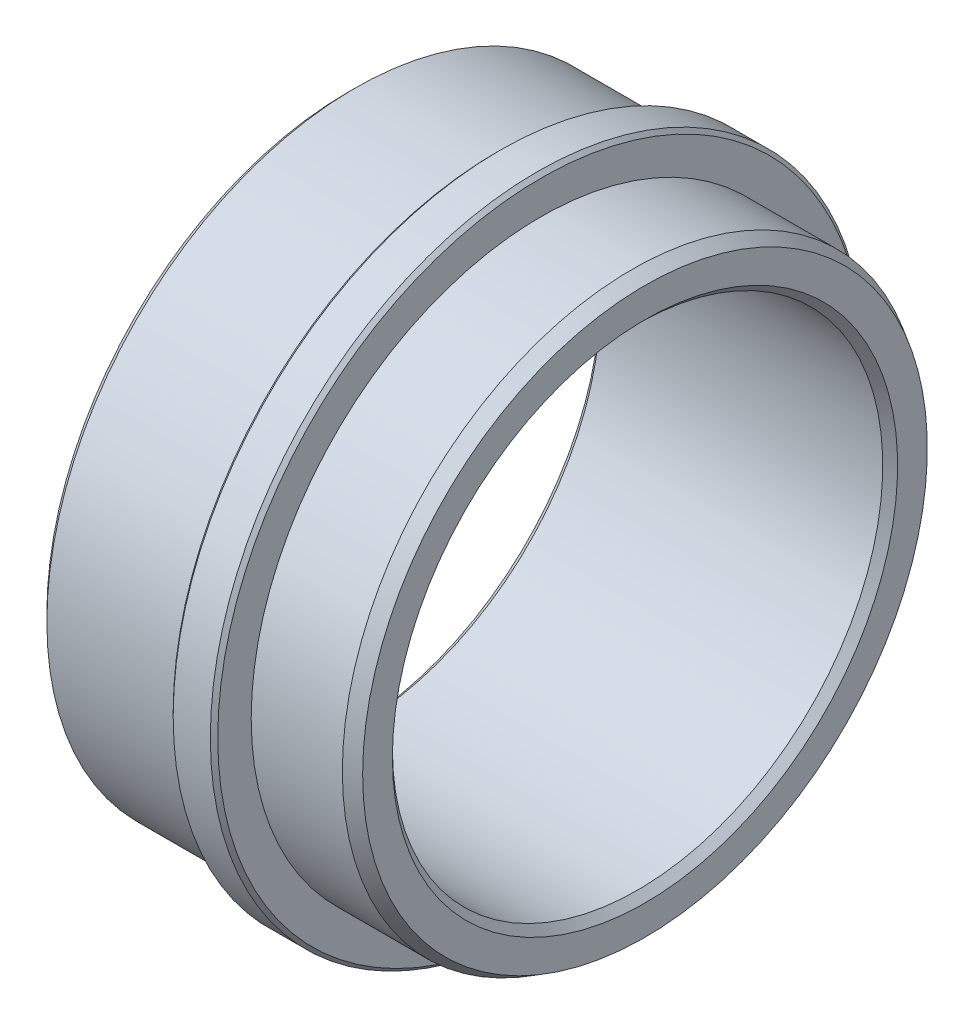
ISO-10303-21;
HEADER;
FILE_DESCRIPTION(('STEP AP214'),'2;1');
FILE_NAME('part.step','',(''),(''),'','','');
FILE_SCHEMA(('AUTOMOTIVE_DESIGN { 1 0 10303 214 1 1 1 1 }'));
ENDSEC;
DATA;
#1=APPLICATION_CONTEXT('core data for automotive mechanical design processes');
#2=APPLICATION_PROTOCOL_DEFINITION('international standard','automotive_design',2000,#1);
#3=PRODUCT_CONTEXT('',#1,'mechanical');
#4=PRODUCT('Part','Part','',(#3));
#5=PRODUCT_RELATED_PRODUCT_CATEGORY('part','',(#4));
#6=PRODUCT_DEFINITION_FORMATION('','',#4);
#7=PRODUCT_DEFINITION_CONTEXT('part definition',#1,'design');
#8=PRODUCT_DEFINITION('design','',#6,#7);
#9=PRODUCT_DEFINITION_SHAPE('','',#8);
#10=(LENGTH_UNIT() NAMED_UNIT(*) SI_UNIT(.MILLI.,.METRE.));
#11=(NAMED_UNIT(*) PLANE_ANGLE_UNIT() SI_UNIT($,.RADIAN.));
#12=(NAMED_UNIT(*) SI_UNIT($,.STERADIAN.) SOLID_ANGLE_UNIT());
#13=UNCERTAINTY_MEASURE_WITH_UNIT(LENGTH_MEASURE(1.E-05),#10,'distance_accuracy_value','');
#14=(GEOMETRIC_REPRESENTATION_CONTEXT(3) GLOBAL_UNCERTAINTY_ASSIGNED_CONTEXT((#13)) GLOBAL_UNIT_ASSIGNED_CONTEXT((#10,
#11,#12)) REPRESENTATION_CONTEXT('',''));
#15=CARTESIAN_POINT('',(0.,0.,0.));
#16=DIRECTION('',(0.,0.,1.));
#17=DIRECTION('',(1.,0.,0.));
#18=AXIS2_PLACEMENT_3D('',#15,#16,#17);
#19=CARTESIAN_POINT('',(-3.94105242786513,20.75,0.));
#20=DIRECTION('',(1.,0.,0.));
#21=DIRECTION('',(0.,0.,-1.));
#22=AXIS2_PLACEMENT_3D('',#19,#20,#21);
#23=PLANE('',#22);
#24=CARTESIAN_POINT('',(-3.94105242786513,0.,0.));
#25=DIRECTION('',(-1.,0.,0.));
#26=DIRECTION('',(0.,0.,1.));
#27=AXIS2_PLACEMENT_3D('',#24,#25,#26);
#28=CIRCLE('',#27,20.75);
#29=CARTESIAN_POINT('',(-3.94105242786513,0.,20.75));
#30=VERTEX_POINT('',#29);
#31=EDGE_CURVE('E79',#30,#30,#28,.T.);
#32=ORIENTED_EDGE('',*,*,#31,.F.);
#33=EDGE_LOOP('',(#32));
#34=FACE_BOUND('',#33,.T.);
#35=CARTESIAN_POINT('',(-3.94105242786513,0.,0.));
#36=DIRECTION('',(-1.,0.,0.));
#37=DIRECTION('',(0.,0.,1.));
#38=AXIS2_PLACEMENT_3D('',#35,#36,#37);
#39=CIRCLE('',#38,21.75);
#40=CARTESIAN_POINT('',(-3.94105242786513,0.,21.75));
#41=VERTEX_POINT('',#40);
#42=EDGE_CURVE('E10',#41,#41,#39,.T.);
#43=ORIENTED_EDGE('',*,*,#42,.T.);
#44=EDGE_LOOP('',(#43));
#45=FACE_BOUND('',#44,.T.);
#46=ADVANCED_FACE('F33',(#34,#45),#23,.F.);
#47=CARTESIAN_POINT('',(-3.69105242786513,0.,0.));
#48=DIRECTION('',(1.,0.,0.));
#49=DIRECTION('',(0.,0.,-1.));
#50=AXIS2_PLACEMENT_3D('',#47,#48,#49);
#51=CONICAL_SURFACE('',#50,22.,0.785398163397449);
#52=ORIENTED_EDGE('',*,*,#42,.F.);
#53=EDGE_LOOP('',(#52));
#54=FACE_BOUND('',#53,.T.);
#55=CARTESIAN_POINT('',(-3.69105242786513,0.,0.));
#56=DIRECTION('',(-1.,0.,0.));
#57=DIRECTION('',(0.,0.,1.));
#58=AXIS2_PLACEMENT_3D('',#55,#56,#57);
#59=CIRCLE('',#58,22.);
#60=CARTESIAN_POINT('',(-3.69105242786513,0.,22.));
#61=VERTEX_POINT('',#60);
#62=EDGE_CURVE('E39',#61,#61,#59,.T.);
#63=ORIENTED_EDGE('',*,*,#62,.T.);
#64=EDGE_LOOP('',(#63));
#65=FACE_BOUND('',#64,.T.);
#66=ADVANCED_FACE('F86',(#54,#65),#51,.T.);
#67=CARTESIAN_POINT('',(0.,0.,0.));
#68=DIRECTION('',(-1.,0.,0.));
#69=DIRECTION('',(0.,0.,1.));
#70=AXIS2_PLACEMENT_3D('',#67,#68,#69);
#71=CYLINDRICAL_SURFACE('',#70,22.);
#72=ORIENTED_EDGE('',*,*,#62,.F.);
#73=EDGE_LOOP('',(#72));
#74=FACE_BOUND('',#73,.T.);
#75=CARTESIAN_POINT('',(-1.19105242786513,0.,0.));
#76=DIRECTION('',(-1.,0.,0.));
#77=DIRECTION('',(0.,0.,1.));
#78=AXIS2_PLACEMENT_3D('',#75,#76,#77);
#79=CIRCLE('',#78,22.);
#80=CARTESIAN_POINT('',(-1.19105242786513,0.,22.));
#81=VERTEX_POINT('',#80);
#82=EDGE_CURVE('E43',#81,#81,#79,.T.);
#83=ORIENTED_EDGE('',*,*,#82,.T.);
#84=EDGE_LOOP('',(#83));
#85=FACE_BOUND('',#84,.T.);
#86=ADVANCED_FACE('F90',(#74,#85),#71,.T.);
#87=CARTESIAN_POINT('',(-0.94105242786513,0.,0.));
#88=DIRECTION('',(-1.,0.,0.));
#89=DIRECTION('',(0.,0.,1.));
#90=AXIS2_PLACEMENT_3D('',#87,#88,#89);
#91=CONICAL_SURFACE('',#90,21.75,0.785398163397449);
#92=ORIENTED_EDGE('',*,*,#82,.F.);
#93=EDGE_LOOP('',(#92));
#94=FACE_BOUND('',#93,.T.);
#95=CARTESIAN_POINT('',(-0.94105242786513,0.,0.));
#96=DIRECTION('',(-1.,0.,0.));
#97=DIRECTION('',(0.,0.,1.));
#98=AXIS2_PLACEMENT_3D('',#95,#96,#97);
#99=CIRCLE('',#98,21.75);
#100=CARTESIAN_POINT('',(-0.94105242786513,0.,21.75));
#101=VERTEX_POINT('',#100);
#102=EDGE_CURVE('E47',#101,#101,#99,.T.);
#103=ORIENTED_EDGE('',*,*,#102,.T.);
#104=EDGE_LOOP('',(#103));
#105=FACE_BOUND('',#104,.T.);
#106=ADVANCED_FACE('F95',(#94,#105),#91,.T.);
#107=CARTESIAN_POINT('',(-0.941052427865129,21.75,0.));
#108=DIRECTION('',(-1.,0.,0.));
#109=DIRECTION('',(0.,0.,1.));
#110=AXIS2_PLACEMENT_3D('',#107,#108,#109);
#111=PLANE('',#110);
#112=ORIENTED_EDGE('',*,*,#102,.F.);
#113=EDGE_LOOP('',(#112));
#114=FACE_BOUND('',#113,.T.);
#115=CARTESIAN_POINT('',(-0.941052427865128,0.,0.));
#116=DIRECTION('',(-1.,0.,0.));
#117=DIRECTION('',(0.,0.,1.));
#118=AXIS2_PLACEMENT_3D('',#115,#116,#117);
#119=CIRCLE('',#118,19.5);
#120=CARTESIAN_POINT('',(-0.941052427865128,0.,19.5));
#121=VERTEX_POINT('',#120);
#122=EDGE_CURVE('E52',#121,#121,#119,.T.);
#123=ORIENTED_EDGE('',*,*,#122,.T.);
#124=EDGE_LOOP('',(#123));
#125=FACE_BOUND('',#124,.T.);
#126=ADVANCED_FACE('F101',(#114,#125),#111,.F.);
#127=CARTESIAN_POINT('',(0.,0.,0.));
#128=DIRECTION('',(-1.,0.,0.));
#129=DIRECTION('',(0.,0.,1.));
#130=AXIS2_PLACEMENT_3D('',#127,#128,#129);
#131=CYLINDRICAL_SURFACE('',#130,19.5);
#132=ORIENTED_EDGE('',*,*,#122,.F.);
#133=EDGE_LOOP('',(#132));
#134=FACE_BOUND('',#133,.T.);
#135=CARTESIAN_POINT('',(5.19292216835042,0.,0.));
#136=DIRECTION('',(-1.,0.,0.));
#137=DIRECTION('',(0.,0.,1.));
#138=AXIS2_PLACEMENT_3D('',#135,#136,#137);
#139=CIRCLE('',#138,19.5);
#140=CARTESIAN_POINT('',(5.19292216835042,0.,19.5));
#141=VERTEX_POINT('',#140);
#142=EDGE_CURVE('E55',#141,#141,#139,.T.);
#143=ORIENTED_EDGE('',*,*,#142,.T.);
#144=EDGE_LOOP('',(#143));
#145=FACE_BOUND('',#144,.T.);
#146=ADVANCED_FACE('F105',(#134,#145),#131,.T.);
#147=CARTESIAN_POINT('',(6.05894757213487,0.,0.));
#148=DIRECTION('',(-1.,0.,0.));
#149=DIRECTION('',(0.,0.,1.));
#150=AXIS2_PLACEMENT_3D('',#147,#148,#149);
#151=CONICAL_SURFACE('',#150,19.,0.523598775598295);
#152=ORIENTED_EDGE('',*,*,#142,.F.);
#153=EDGE_LOOP('',(#152));
#154=FACE_BOUND('',#153,.T.);
#155=CARTESIAN_POINT('',(6.05894757213487,0.,0.));
#156=DIRECTION('',(-1.,0.,0.));
#157=DIRECTION('',(0.,0.,1.));
#158=AXIS2_PLACEMENT_3D('',#155,#156,#157);
#159=CIRCLE('',#158,19.);
#160=CARTESIAN_POINT('',(6.05894757213487,0.,19.));
#161=VERTEX_POINT('',#160);
#162=EDGE_CURVE('E58',#161,#161,#159,.T.);
#163=ORIENTED_EDGE('',*,*,#162,.T.);
#164=EDGE_LOOP('',(#163));
#165=FACE_BOUND('',#164,.T.);
#166=ADVANCED_FACE('F109',(#154,#165),#151,.T.);
#167=CARTESIAN_POINT('',(6.05894757213487,19.,0.));
#168=DIRECTION('',(-1.,0.,0.));
#169=DIRECTION('',(0.,0.,1.));
#170=AXIS2_PLACEMENT_3D('',#167,#168,#169);
#171=PLANE('',#170);
#172=ORIENTED_EDGE('',*,*,#162,.F.);
#173=EDGE_LOOP('',(#172));
#174=FACE_BOUND('',#173,.T.);
#175=CARTESIAN_POINT('',(6.05894757213487,0.,0.));
#176=DIRECTION('',(-1.,0.,0.));
#177=DIRECTION('',(0.,0.,1.));
#178=AXIS2_PLACEMENT_3D('',#175,#176,#177);
#179=CIRCLE('',#178,17.);
#180=CARTESIAN_POINT('',(6.05894757213487,0.,17.));
#181=VERTEX_POINT('',#180);
#182=EDGE_CURVE('E61',#181,#181,#179,.T.);
#183=ORIENTED_EDGE('',*,*,#182,.T.);
#184=EDGE_LOOP('',(#183));
#185=FACE_BOUND('',#184,.T.);
#186=ADVANCED_FACE('F113',(#174,#185),#171,.F.);
#187=CARTESIAN_POINT('',(5.55894757213487,0.,0.));
#188=DIRECTION('',(1.,0.,0.));
#189=DIRECTION('',(0.,0.,-1.));
#190=AXIS2_PLACEMENT_3D('',#187,#188,#189);
#191=CONICAL_SURFACE('',#190,16.5,0.785398163397448);
#192=ORIENTED_EDGE('',*,*,#182,.F.);
#193=EDGE_LOOP('',(#192));
#194=FACE_BOUND('',#193,.T.);
#195=CARTESIAN_POINT('',(5.55894757213487,0.,0.));
#196=DIRECTION('',(-1.,0.,0.));
#197=DIRECTION('',(0.,0.,1.));
#198=AXIS2_PLACEMENT_3D('',#195,#196,#197);
#199=CIRCLE('',#198,16.5);
#200=CARTESIAN_POINT('',(5.55894757213487,0.,16.5));
#201=VERTEX_POINT('',#200);
#202=EDGE_CURVE('E64',#201,#201,#199,.T.);
#203=ORIENTED_EDGE('',*,*,#202,.T.);
#204=EDGE_LOOP('',(#203));
#205=FACE_BOUND('',#204,.T.);
#206=ADVANCED_FACE('F117',(#194,#205),#191,.F.);
#207=CARTESIAN_POINT('',(0.,0.,0.));
#208=DIRECTION('',(-1.,0.,0.));
#209=DIRECTION('',(0.,0.,1.));
#210=AXIS2_PLACEMENT_3D('',#207,#208,#209);
#211=CYLINDRICAL_SURFACE('',#210,16.5);
#212=ORIENTED_EDGE('',*,*,#202,.F.);
#213=EDGE_LOOP('',(#212));
#214=FACE_BOUND('',#213,.T.);
#215=CARTESIAN_POINT('',(-13.4410524278651,0.,0.));
#216=DIRECTION('',(-1.,0.,0.));
#217=DIRECTION('',(0.,0.,1.));
#218=AXIS2_PLACEMENT_3D('',#215,#216,#217);
#219=CIRCLE('',#218,16.5);
#220=CARTESIAN_POINT('',(-13.4410524278651,0.,16.5));
#221=VERTEX_POINT('',#220);
#222=EDGE_CURVE('E67',#221,#221,#219,.T.);
#223=ORIENTED_EDGE('',*,*,#222,.T.);
#224=EDGE_LOOP('',(#223));
#225=FACE_BOUND('',#224,.T.);
#226=ADVANCED_FACE('F121',(#214,#225),#211,.F.);
#227=CARTESIAN_POINT('',(-13.9410524278651,0.,0.));
#228=DIRECTION('',(-1.,0.,0.));
#229=DIRECTION('',(0.,0.,1.));
#230=AXIS2_PLACEMENT_3D('',#227,#228,#229);
#231=CONICAL_SURFACE('',#230,17.,0.785398163397443);
#232=ORIENTED_EDGE('',*,*,#222,.F.);
#233=EDGE_LOOP('',(#232));
#234=FACE_BOUND('',#233,.T.);
#235=CARTESIAN_POINT('',(-13.9410524278651,0.,0.));
#236=DIRECTION('',(-1.,0.,0.));
#237=DIRECTION('',(0.,0.,1.));
#238=AXIS2_PLACEMENT_3D('',#235,#236,#237);
#239=CIRCLE('',#238,17.);
#240=CARTESIAN_POINT('',(-13.9410524278651,0.,17.));
#241=VERTEX_POINT('',#240);
#242=EDGE_CURVE('E70',#241,#241,#239,.T.);
#243=ORIENTED_EDGE('',*,*,#242,.T.);
#244=EDGE_LOOP('',(#243));
#245=FACE_BOUND('',#244,.T.);
#246=ADVANCED_FACE('F125',(#234,#245),#231,.F.);
#247=CARTESIAN_POINT('',(-13.9410524278651,17.,0.));
#248=DIRECTION('',(1.,0.,0.));
#249=DIRECTION('',(0.,0.,-1.));
#250=AXIS2_PLACEMENT_3D('',#247,#248,#249);
#251=PLANE('',#250);
#252=ORIENTED_EDGE('',*,*,#242,.F.);
#253=EDGE_LOOP('',(#252));
#254=FACE_BOUND('',#253,.T.);
#255=CARTESIAN_POINT('',(-13.9410524278651,0.,0.));
#256=DIRECTION('',(-1.,0.,0.));
#257=DIRECTION('',(0.,0.,1.));
#258=AXIS2_PLACEMENT_3D('',#255,#256,#257);
#259=CIRCLE('',#258,20.25);
#260=CARTESIAN_POINT('',(-13.9410524278651,0.,20.25));
#261=VERTEX_POINT('',#260);
#262=EDGE_CURVE('E73',#261,#261,#259,.T.);
#263=ORIENTED_EDGE('',*,*,#262,.T.);
#264=EDGE_LOOP('',(#263));
#265=FACE_BOUND('',#264,.T.);
#266=ADVANCED_FACE('F129',(#254,#265),#251,.F.);
#267=CARTESIAN_POINT('',(-13.4410524278651,0.,0.));
#268=DIRECTION('',(1.,0.,0.));
#269=DIRECTION('',(0.,0.,-1.));
#270=AXIS2_PLACEMENT_3D('',#267,#268,#269);
#271=CONICAL_SURFACE('',#270,20.75,0.785398163397438);
#272=ORIENTED_EDGE('',*,*,#262,.F.);
#273=EDGE_LOOP('',(#272));
#274=FACE_BOUND('',#273,.T.);
#275=CARTESIAN_POINT('',(-13.4410524278651,0.,0.));
#276=DIRECTION('',(-1.,0.,0.));
#277=DIRECTION('',(0.,0.,1.));
#278=AXIS2_PLACEMENT_3D('',#275,#276,#277);
#279=CIRCLE('',#278,20.75);
#280=CARTESIAN_POINT('',(-13.4410524278651,0.,20.75));
#281=VERTEX_POINT('',#280);
#282=EDGE_CURVE('E76',#281,#281,#279,.T.);
#283=ORIENTED_EDGE('',*,*,#282,.T.);
#284=EDGE_LOOP('',(#283));
#285=FACE_BOUND('',#284,.T.);
#286=ADVANCED_FACE('F133',(#274,#285),#271,.T.);
#287=CARTESIAN_POINT('',(0.,0.,0.));
#288=DIRECTION('',(-1.,0.,0.));
#289=DIRECTION('',(0.,0.,1.));
#290=AXIS2_PLACEMENT_3D('',#287,#288,#289);
#291=CYLINDRICAL_SURFACE('',#290,20.75);
#292=ORIENTED_EDGE('',*,*,#282,.F.);
#293=EDGE_LOOP('',(#292));
#294=FACE_BOUND('',#293,.T.);
#295=ORIENTED_EDGE('',*,*,#31,.T.);
#296=EDGE_LOOP('',(#295));
#297=FACE_BOUND('',#296,.T.);
#298=ADVANCED_FACE('F83',(#294,#297),#291,.T.);
#299=CLOSED_SHELL('',(#46,#66,#86,#106,#126,#146,#166,#186,#206,#226,#246,#266,#286,#298));
#300=MANIFOLD_SOLID_BREP('B2',#299);
#301=ADVANCED_BREP_SHAPE_REPRESENTATION('',(#18,#300),#14);
#302=SHAPE_DEFINITION_REPRESENTATION(#9,#301);
ENDSEC;
END-ISO-10303-21;
